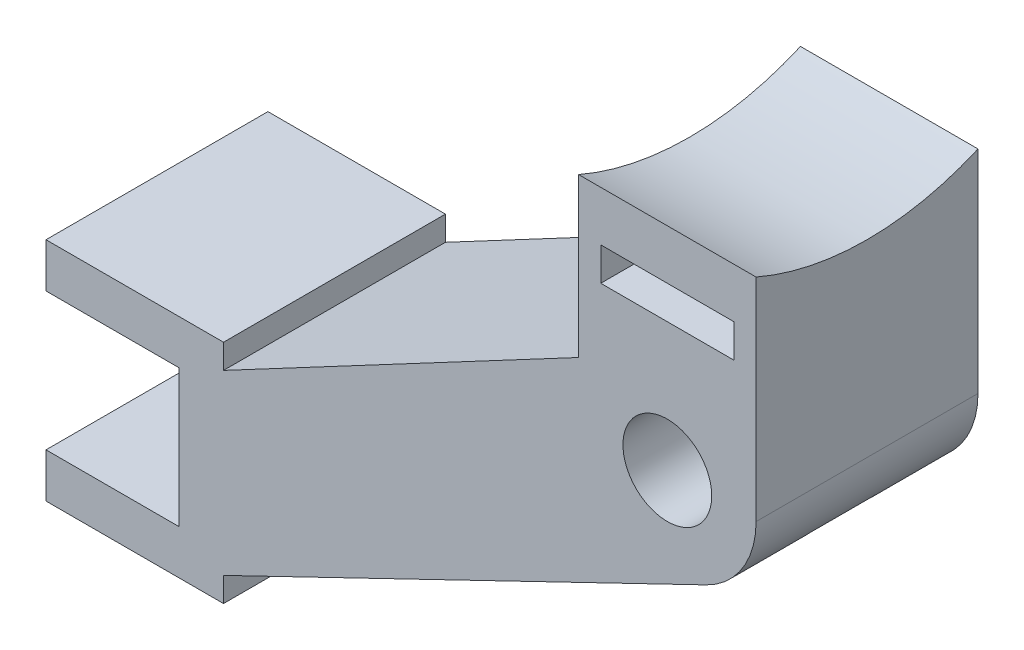
ISO-10303-21;
HEADER;
FILE_DESCRIPTION(('STEP AP214'),'2;1');
FILE_NAME('part.step','',(''),(''),'','','');
FILE_SCHEMA(('AUTOMOTIVE_DESIGN { 1 0 10303 214 1 1 1 1 }'));
ENDSEC;
DATA;
#1=APPLICATION_CONTEXT('core data for automotive mechanical design processes');
#2=APPLICATION_PROTOCOL_DEFINITION('international standard','automotive_design',2000,#1);
#3=PRODUCT_CONTEXT('',#1,'mechanical');
#4=PRODUCT('Part','Part','',(#3));
#5=PRODUCT_RELATED_PRODUCT_CATEGORY('part','',(#4));
#6=PRODUCT_DEFINITION_FORMATION('','',#4);
#7=PRODUCT_DEFINITION_CONTEXT('part definition',#1,'design');
#8=PRODUCT_DEFINITION('design','',#6,#7);
#9=PRODUCT_DEFINITION_SHAPE('','',#8);
#10=(LENGTH_UNIT() NAMED_UNIT(*) SI_UNIT(.MILLI.,.METRE.));
#11=(NAMED_UNIT(*) PLANE_ANGLE_UNIT() SI_UNIT($,.RADIAN.));
#12=(NAMED_UNIT(*) SI_UNIT($,.STERADIAN.) SOLID_ANGLE_UNIT());
#13=UNCERTAINTY_MEASURE_WITH_UNIT(LENGTH_MEASURE(1.E-05),#10,'distance_accuracy_value','');
#14=(GEOMETRIC_REPRESENTATION_CONTEXT(3) GLOBAL_UNCERTAINTY_ASSIGNED_CONTEXT((#13)) GLOBAL_UNIT_ASSIGNED_CONTEXT((#10,
#11,#12)) REPRESENTATION_CONTEXT('',''));
#15=CARTESIAN_POINT('',(0.,0.,0.));
#16=DIRECTION('',(0.,0.,1.));
#17=DIRECTION('',(1.,0.,0.));
#18=AXIS2_PLACEMENT_3D('',#15,#16,#17);
#19=CARTESIAN_POINT('',(-20.,-14.1,10.));
#20=DIRECTION('',(-0.434853391635676,0.900501264731455,0.));
#21=DIRECTION('',(-0.900501264731455,-0.434853391635676,0.));
#22=AXIS2_PLACEMENT_3D('',#19,#20,#21);
#23=PLANE('',#22);
#24=DIRECTION('',(-0.900501264731455,-0.434853391635676,0.));
#25=VECTOR('',#24,1.);
#26=CARTESIAN_POINT('',(-6.64579324577376,-7.65123382151927,3.5));
#27=LINE('',#26,#25);
#28=CARTESIAN_POINT('',(1.7394135665427,-3.60200505892582,3.5));
#29=VERTEX_POINT('',#28);
#30=CARTESIAN_POINT('',(-3.,-5.8906748748309,3.5));
#31=VERTEX_POINT('',#30);
#32=EDGE_CURVE('E200',#29,#31,#27,.T.);
#33=ORIENTED_EDGE('',*,*,#32,.T.);
#34=DIRECTION('',(0.,0.,-1.));
#35=VECTOR('',#34,1.);
#36=CARTESIAN_POINT('',(-3.,-5.8906748748309,3.5));
#37=LINE('',#36,#35);
#38=CARTESIAN_POINT('',(-3.,-5.8906748748309,6.5));
#39=VERTEX_POINT('',#38);
#40=EDGE_CURVE('E211',#39,#31,#37,.T.);
#41=ORIENTED_EDGE('',*,*,#40,.F.);
#42=DIRECTION('',(-0.900501264731455,-0.434853391635676,0.));
#43=VECTOR('',#42,1.);
#44=CARTESIAN_POINT('',(-6.64579324577376,-7.65123382151927,6.5));
#45=LINE('',#44,#43);
#46=CARTESIAN_POINT('',(1.7394135665427,-3.60200505892582,6.5));
#47=VERTEX_POINT('',#46);
#48=EDGE_CURVE('E223',#47,#39,#45,.T.);
#49=ORIENTED_EDGE('',*,*,#48,.F.);
#50=DIRECTION('',(0.,0.,-1.));
#51=VECTOR('',#50,1.);
#52=CARTESIAN_POINT('',(1.7394135665427,-3.60200505892582,10.));
#53=LINE('',#52,#51);
#54=CARTESIAN_POINT('',(1.7394135665427,-3.60200505892582,10.));
#55=VERTEX_POINT('',#54);
#56=EDGE_CURVE('E368',#55,#47,#53,.T.);
#57=ORIENTED_EDGE('',*,*,#56,.F.);
#58=DIRECTION('',(0.900501264731455,0.434853391635676,0.));
#59=VECTOR('',#58,1.);
#60=CARTESIAN_POINT('',(-20.,-14.1,10.));
#61=LINE('',#60,#59);
#62=CARTESIAN_POINT('',(-20.,-14.1,10.));
#63=VERTEX_POINT('',#62);
#64=EDGE_CURVE('E312',#63,#55,#61,.T.);
#65=ORIENTED_EDGE('',*,*,#64,.F.);
#66=DIRECTION('',(0.,0.,-1.));
#67=VECTOR('',#66,1.);
#68=CARTESIAN_POINT('',(-20.,-14.1,10.));
#69=LINE('',#68,#67);
#70=CARTESIAN_POINT('',(-20.,-14.1,0.));
#71=VERTEX_POINT('',#70);
#72=EDGE_CURVE('E371',#63,#71,#69,.T.);
#73=ORIENTED_EDGE('',*,*,#72,.T.);
#74=DIRECTION('',(0.900501264731455,0.434853391635676,0.));
#75=VECTOR('',#74,1.);
#76=CARTESIAN_POINT('',(-20.,-14.1,0.));
#77=LINE('',#76,#75);
#78=CARTESIAN_POINT('',(1.7394135665427,-3.60200505892582,0.));
#79=VERTEX_POINT('',#78);
#80=EDGE_CURVE('E341',#71,#79,#77,.T.);
#81=ORIENTED_EDGE('',*,*,#80,.T.);
#82=EDGE_CURVE('E221',#29,#79,#53,.T.);
#83=ORIENTED_EDGE('',*,*,#82,.F.);
#84=EDGE_LOOP('',(#33,#41,#49,#57,#65,#73,#81,#83));
#85=FACE_BOUND('',#84,.T.);
#86=ADVANCED_FACE('F35',(#85),#23,.F.);
#87=CARTESIAN_POINT('',(0.,0.,10.));
#88=DIRECTION('',(0.,0.,-1.));
#89=DIRECTION('',(-1.,0.,0.));
#90=AXIS2_PLACEMENT_3D('',#87,#88,#89);
#91=CYLINDRICAL_SURFACE('',#90,4.);
#92=CARTESIAN_POINT('',(0.,0.,3.5));
#93=DIRECTION('',(0.,0.,1.));
#94=DIRECTION('',(1.,0.,0.));
#95=AXIS2_PLACEMENT_3D('',#92,#93,#94);
#96=CIRCLE('',#95,4.);
#97=CARTESIAN_POINT('',(3.,-2.64575131106459,3.5));
#98=VERTEX_POINT('',#97);
#99=EDGE_CURVE('E234',#98,#29,#96,.F.);
#100=ORIENTED_EDGE('',*,*,#99,.T.);
#101=ORIENTED_EDGE('',*,*,#82,.T.);
#102=CARTESIAN_POINT('',(0.,0.,0.));
#103=DIRECTION('',(0.,0.,1.));
#104=DIRECTION('',(1.,0.,0.));
#105=AXIS2_PLACEMENT_3D('',#102,#103,#104);
#106=CIRCLE('',#105,4.);
#107=CARTESIAN_POINT('',(4.,0.,0.));
#108=VERTEX_POINT('',#107);
#109=EDGE_CURVE('E343',#79,#108,#106,.T.);
#110=ORIENTED_EDGE('',*,*,#109,.T.);
#111=DIRECTION('',(0.,0.,-1.));
#112=VECTOR('',#111,1.);
#113=CARTESIAN_POINT('',(4.,0.,10.));
#114=LINE('',#113,#112);
#115=CARTESIAN_POINT('',(4.,0.,10.));
#116=VERTEX_POINT('',#115);
#117=EDGE_CURVE('E365',#116,#108,#114,.T.);
#118=ORIENTED_EDGE('',*,*,#117,.F.);
#119=CARTESIAN_POINT('',(0.,0.,10.));
#120=DIRECTION('',(0.,0.,1.));
#121=DIRECTION('',(1.,0.,0.));
#122=AXIS2_PLACEMENT_3D('',#119,#120,#121);
#123=CIRCLE('',#122,4.);
#124=EDGE_CURVE('E314',#55,#116,#123,.T.);
#125=ORIENTED_EDGE('',*,*,#124,.F.);
#126=ORIENTED_EDGE('',*,*,#56,.T.);
#127=CARTESIAN_POINT('',(0.,0.,6.5));
#128=DIRECTION('',(0.,0.,1.));
#129=DIRECTION('',(1.,0.,0.));
#130=AXIS2_PLACEMENT_3D('',#127,#128,#129);
#131=CIRCLE('',#130,4.);
#132=CARTESIAN_POINT('',(3.,-2.64575131106459,6.5));
#133=VERTEX_POINT('',#132);
#134=EDGE_CURVE('E216',#133,#47,#131,.F.);
#135=ORIENTED_EDGE('',*,*,#134,.F.);
#136=DIRECTION('',(0.,0.,-1.));
#137=VECTOR('',#136,1.);
#138=CARTESIAN_POINT('',(3.,-2.64575131106459,10.));
#139=LINE('',#138,#137);
#140=EDGE_CURVE('E50',#133,#98,#139,.T.);
#141=ORIENTED_EDGE('',*,*,#140,.T.);
#142=EDGE_LOOP('',(#100,#101,#110,#118,#125,#126,#135,#141));
#143=FACE_BOUND('',#142,.T.);
#144=ADVANCED_FACE('F451',(#143),#91,.T.);
#145=CARTESIAN_POINT('',(0.,0.,10.));
#146=DIRECTION('',(0.,0.,-1.));
#147=DIRECTION('',(-1.,0.,0.));
#148=AXIS2_PLACEMENT_3D('',#145,#146,#147);
#149=CYLINDRICAL_SURFACE('',#148,2.);
#150=CARTESIAN_POINT('',(0.,0.,0.));
#151=DIRECTION('',(0.,0.,1.));
#152=DIRECTION('',(1.,0.,0.));
#153=AXIS2_PLACEMENT_3D('',#150,#151,#152);
#154=CIRCLE('',#153,2.);
#155=CARTESIAN_POINT('',(2.,0.,0.));
#156=VERTEX_POINT('',#155);
#157=EDGE_CURVE('E289',#156,#156,#154,.T.);
#158=ORIENTED_EDGE('',*,*,#157,.F.);
#159=EDGE_LOOP('',(#158));
#160=FACE_BOUND('',#159,.T.);
#161=CARTESIAN_POINT('',(0.,0.,3.5));
#162=DIRECTION('',(0.,0.,1.));
#163=DIRECTION('',(1.,0.,0.));
#164=AXIS2_PLACEMENT_3D('',#161,#162,#163);
#165=CIRCLE('',#164,2.);
#166=CARTESIAN_POINT('',(2.,0.,3.5));
#167=VERTEX_POINT('',#166);
#168=EDGE_CURVE('E229',#167,#167,#165,.F.);
#169=ORIENTED_EDGE('',*,*,#168,.F.);
#170=EDGE_LOOP('',(#169));
#171=FACE_BOUND('',#170,.T.);
#172=ADVANCED_FACE('F473',(#160,#171),#149,.F.);
#173=CARTESIAN_POINT('',(0.,0.,10.));
#174=DIRECTION('',(0.,0.,1.));
#175=DIRECTION('',(1.,0.,0.));
#176=AXIS2_PLACEMENT_3D('',#173,#174,#175);
#177=PLANE('',#176);
#178=DIRECTION('',(0.,-1.,0.));
#179=VECTOR('',#178,1.);
#180=CARTESIAN_POINT('',(-28.,-7.,10.));
#181=LINE('',#180,#179);
#182=CARTESIAN_POINT('',(-28.,-5.,10.));
#183=VERTEX_POINT('',#182);
#184=CARTESIAN_POINT('',(-28.,-7.,10.));
#185=VERTEX_POINT('',#184);
#186=EDGE_CURVE('E296',#183,#185,#181,.T.);
#187=ORIENTED_EDGE('',*,*,#186,.T.);
#188=DIRECTION('',(1.,0.,0.));
#189=VECTOR('',#188,1.);
#190=CARTESIAN_POINT('',(-28.,-7.,10.));
#191=LINE('',#190,#189);
#192=CARTESIAN_POINT('',(-22.,-7.,10.));
#193=VERTEX_POINT('',#192);
#194=EDGE_CURVE('E299',#185,#193,#191,.T.);
#195=ORIENTED_EDGE('',*,*,#194,.T.);
#196=DIRECTION('',(0.,-1.,0.));
#197=VECTOR('',#196,1.);
#198=CARTESIAN_POINT('',(-22.,-7.,10.));
#199=LINE('',#198,#197);
#200=CARTESIAN_POINT('',(-22.,-13.2,10.));
#201=VERTEX_POINT('',#200);
#202=EDGE_CURVE('E302',#193,#201,#199,.T.);
#203=ORIENTED_EDGE('',*,*,#202,.T.);
#204=DIRECTION('',(-1.,0.,0.));
#205=VECTOR('',#204,1.);
#206=CARTESIAN_POINT('',(-22.,-13.2,10.));
#207=LINE('',#206,#205);
#208=CARTESIAN_POINT('',(-28.,-13.2,10.));
#209=VERTEX_POINT('',#208);
#210=EDGE_CURVE('E304',#201,#209,#207,.T.);
#211=ORIENTED_EDGE('',*,*,#210,.T.);
#212=DIRECTION('',(0.,-1.,0.));
#213=VECTOR('',#212,1.);
#214=CARTESIAN_POINT('',(-28.,-13.2,10.));
#215=LINE('',#214,#213);
#216=CARTESIAN_POINT('',(-28.,-15.2,10.));
#217=VERTEX_POINT('',#216);
#218=EDGE_CURVE('E306',#209,#217,#215,.T.);
#219=ORIENTED_EDGE('',*,*,#218,.T.);
#220=DIRECTION('',(1.,0.,0.));
#221=VECTOR('',#220,1.);
#222=CARTESIAN_POINT('',(-28.,-15.2,10.));
#223=LINE('',#222,#221);
#224=CARTESIAN_POINT('',(-20.,-15.2,10.));
#225=VERTEX_POINT('',#224);
#226=EDGE_CURVE('E308',#217,#225,#223,.T.);
#227=ORIENTED_EDGE('',*,*,#226,.T.);
#228=DIRECTION('',(0.,1.,0.));
#229=VECTOR('',#228,1.);
#230=CARTESIAN_POINT('',(-20.,-15.2,10.));
#231=LINE('',#230,#229);
#232=EDGE_CURVE('E310',#225,#63,#231,.T.);
#233=ORIENTED_EDGE('',*,*,#232,.T.);
#234=ORIENTED_EDGE('',*,*,#64,.T.);
#235=ORIENTED_EDGE('',*,*,#124,.T.);
#236=DIRECTION('',(0.,1.,0.));
#237=VECTOR('',#236,1.);
#238=CARTESIAN_POINT('',(4.,8.,10.));
#239=LINE('',#238,#237);
#240=CARTESIAN_POINT('',(4.,9.5435607626104,10.));
#241=VERTEX_POINT('',#240);
#242=EDGE_CURVE('E316',#116,#241,#239,.T.);
#243=ORIENTED_EDGE('',*,*,#242,.T.);
#244=DIRECTION('',(-1.,0.,0.));
#245=VECTOR('',#244,1.);
#246=CARTESIAN_POINT('',(14.118427734973,9.5435607626104,10.));
#247=LINE('',#246,#245);
#248=CARTESIAN_POINT('',(-4.,9.5435607626104,10.));
#249=VERTEX_POINT('',#248);
#250=EDGE_CURVE('E253',#241,#249,#247,.T.);
#251=ORIENTED_EDGE('',*,*,#250,.T.);
#252=DIRECTION('',(0.,-1.,0.));
#253=VECTOR('',#252,1.);
#254=CARTESIAN_POINT('',(-4.,2.40390021292767,10.));
#255=LINE('',#254,#253);
#256=CARTESIAN_POINT('',(-4.,2.40390021292767,10.));
#257=VERTEX_POINT('',#256);
#258=EDGE_CURVE('E318',#249,#257,#255,.T.);
#259=ORIENTED_EDGE('',*,*,#258,.T.);
#260=DIRECTION('',(-0.883026521697402,-0.469323089117708,0.));
#261=VECTOR('',#260,1.);
#262=CARTESIAN_POINT('',(-20.,-6.1,10.));
#263=LINE('',#262,#261);
#264=CARTESIAN_POINT('',(-20.,-6.1,10.));
#265=VERTEX_POINT('',#264);
#266=EDGE_CURVE('E320',#257,#265,#263,.T.);
#267=ORIENTED_EDGE('',*,*,#266,.T.);
#268=DIRECTION('',(0.,1.,0.));
#269=VECTOR('',#268,1.);
#270=CARTESIAN_POINT('',(-20.,-5.,10.));
#271=LINE('',#270,#269);
#272=CARTESIAN_POINT('',(-20.,-5.,10.));
#273=VERTEX_POINT('',#272);
#274=EDGE_CURVE('E322',#265,#273,#271,.T.);
#275=ORIENTED_EDGE('',*,*,#274,.T.);
#276=DIRECTION('',(-1.,0.,0.));
#277=VECTOR('',#276,1.);
#278=CARTESIAN_POINT('',(-28.,-5.,10.));
#279=LINE('',#278,#277);
#280=EDGE_CURVE('E324',#273,#183,#279,.T.);
#281=ORIENTED_EDGE('',*,*,#280,.T.);
#282=EDGE_LOOP('',(#187,#195,#203,#211,#219,#227,#233,#234,#235,#243,#251,#259,#267,#275,#281));
#283=FACE_BOUND('',#282,.T.);
#284=CARTESIAN_POINT('',(0.,0.,10.));
#285=DIRECTION('',(0.,0.,1.));
#286=DIRECTION('',(1.,0.,0.));
#287=AXIS2_PLACEMENT_3D('',#284,#285,#286);
#288=CIRCLE('',#287,2.);
#289=CARTESIAN_POINT('',(2.,0.,10.));
#290=VERTEX_POINT('',#289);
#291=EDGE_CURVE('E290',#290,#290,#288,.T.);
#292=ORIENTED_EDGE('',*,*,#291,.F.);
#293=EDGE_LOOP('',(#292));
#294=FACE_BOUND('',#293,.T.);
#295=DIRECTION('',(-1.,0.,0.));
#296=VECTOR('',#295,1.);
#297=CARTESIAN_POINT('',(-3.,7.3,10.));
#298=LINE('',#297,#296);
#299=CARTESIAN_POINT('',(3.,7.3,10.));
#300=VERTEX_POINT('',#299);
#301=CARTESIAN_POINT('',(-3.,7.3,10.));
#302=VERTEX_POINT('',#301);
#303=EDGE_CURVE('E263',#300,#302,#298,.T.);
#304=ORIENTED_EDGE('',*,*,#303,.F.);
#305=DIRECTION('',(0.,1.,0.));
#306=VECTOR('',#305,1.);
#307=CARTESIAN_POINT('',(3.,7.3,10.));
#308=LINE('',#307,#306);
#309=CARTESIAN_POINT('',(3.,5.8,10.));
#310=VERTEX_POINT('',#309);
#311=EDGE_CURVE('E261',#310,#300,#308,.T.);
#312=ORIENTED_EDGE('',*,*,#311,.F.);
#313=DIRECTION('',(1.,0.,0.));
#314=VECTOR('',#313,1.);
#315=CARTESIAN_POINT('',(-3.,5.8,10.));
#316=LINE('',#315,#314);
#317=CARTESIAN_POINT('',(-3.,5.8,10.));
#318=VERTEX_POINT('',#317);
#319=EDGE_CURVE('E268',#318,#310,#316,.T.);
#320=ORIENTED_EDGE('',*,*,#319,.F.);
#321=DIRECTION('',(0.,-1.,0.));
#322=VECTOR('',#321,1.);
#323=CARTESIAN_POINT('',(-3.,7.3,10.));
#324=LINE('',#323,#322);
#325=EDGE_CURVE('E266',#302,#318,#324,.T.);
#326=ORIENTED_EDGE('',*,*,#325,.F.);
#327=EDGE_LOOP('',(#304,#312,#320,#326));
#328=FACE_BOUND('',#327,.T.);
#329=ADVANCED_FACE('F410',(#283,#294,#328),#177,.T.);
#330=CARTESIAN_POINT('',(0.,0.,0.));
#331=DIRECTION('',(0.,0.,1.));
#332=DIRECTION('',(1.,0.,0.));
#333=AXIS2_PLACEMENT_3D('',#330,#331,#332);
#334=PLANE('',#333);
#335=ORIENTED_EDGE('',*,*,#157,.T.);
#336=EDGE_LOOP('',(#335));
#337=FACE_BOUND('',#336,.T.);
#338=DIRECTION('',(0.,-1.,0.));
#339=VECTOR('',#338,1.);
#340=CARTESIAN_POINT('',(-28.,-7.,0.));
#341=LINE('',#340,#339);
#342=CARTESIAN_POINT('',(-28.,-5.,0.));
#343=VERTEX_POINT('',#342);
#344=CARTESIAN_POINT('',(-28.,-7.,0.));
#345=VERTEX_POINT('',#344);
#346=EDGE_CURVE('E293',#343,#345,#341,.T.);
#347=ORIENTED_EDGE('',*,*,#346,.F.);
#348=DIRECTION('',(-1.,0.,0.));
#349=VECTOR('',#348,1.);
#350=CARTESIAN_POINT('',(-28.,-5.,0.));
#351=LINE('',#350,#349);
#352=CARTESIAN_POINT('',(-20.,-5.,0.));
#353=VERTEX_POINT('',#352);
#354=EDGE_CURVE('E300',#353,#343,#351,.T.);
#355=ORIENTED_EDGE('',*,*,#354,.F.);
#356=DIRECTION('',(0.,1.,0.));
#357=VECTOR('',#356,1.);
#358=CARTESIAN_POINT('',(-20.,-5.,0.));
#359=LINE('',#358,#357);
#360=CARTESIAN_POINT('',(-20.,-6.1,0.));
#361=VERTEX_POINT('',#360);
#362=EDGE_CURVE('E351',#361,#353,#359,.T.);
#363=ORIENTED_EDGE('',*,*,#362,.F.);
#364=DIRECTION('',(-0.883026521697402,-0.469323089117708,0.));
#365=VECTOR('',#364,1.);
#366=CARTESIAN_POINT('',(-20.,-6.1,0.));
#367=LINE('',#366,#365);
#368=CARTESIAN_POINT('',(-4.,2.40390021292767,0.));
#369=VERTEX_POINT('',#368);
#370=EDGE_CURVE('E349',#369,#361,#367,.T.);
#371=ORIENTED_EDGE('',*,*,#370,.F.);
#372=DIRECTION('',(0.,-1.,0.));
#373=VECTOR('',#372,1.);
#374=CARTESIAN_POINT('',(-4.,2.40390021292767,0.));
#375=LINE('',#374,#373);
#376=CARTESIAN_POINT('',(-4.,9.54356076261041,0.));
#377=VERTEX_POINT('',#376);
#378=EDGE_CURVE('E347',#377,#369,#375,.T.);
#379=ORIENTED_EDGE('',*,*,#378,.F.);
#380=DIRECTION('',(-1.,0.,0.));
#381=VECTOR('',#380,1.);
#382=CARTESIAN_POINT('',(14.118427734973,9.54356076261041,0.));
#383=LINE('',#382,#381);
#384=CARTESIAN_POINT('',(4.,9.54356076261041,0.));
#385=VERTEX_POINT('',#384);
#386=EDGE_CURVE('E256',#385,#377,#383,.T.);
#387=ORIENTED_EDGE('',*,*,#386,.F.);
#388=DIRECTION('',(0.,1.,0.));
#389=VECTOR('',#388,1.);
#390=CARTESIAN_POINT('',(4.,8.,0.));
#391=LINE('',#390,#389);
#392=EDGE_CURVE('E345',#108,#385,#391,.T.);
#393=ORIENTED_EDGE('',*,*,#392,.F.);
#394=ORIENTED_EDGE('',*,*,#109,.F.);
#395=ORIENTED_EDGE('',*,*,#80,.F.);
#396=DIRECTION('',(0.,1.,0.));
#397=VECTOR('',#396,1.);
#398=CARTESIAN_POINT('',(-20.,-15.2,0.));
#399=LINE('',#398,#397);
#400=CARTESIAN_POINT('',(-20.,-15.2,0.));
#401=VERTEX_POINT('',#400);
#402=EDGE_CURVE('E339',#401,#71,#399,.T.);
#403=ORIENTED_EDGE('',*,*,#402,.F.);
#404=DIRECTION('',(1.,0.,0.));
#405=VECTOR('',#404,1.);
#406=CARTESIAN_POINT('',(-28.,-15.2,0.));
#407=LINE('',#406,#405);
#408=CARTESIAN_POINT('',(-28.,-15.2,0.));
#409=VERTEX_POINT('',#408);
#410=EDGE_CURVE('E337',#409,#401,#407,.T.);
#411=ORIENTED_EDGE('',*,*,#410,.F.);
#412=DIRECTION('',(0.,-1.,0.));
#413=VECTOR('',#412,1.);
#414=CARTESIAN_POINT('',(-28.,-13.2,0.));
#415=LINE('',#414,#413);
#416=CARTESIAN_POINT('',(-28.,-13.2,0.));
#417=VERTEX_POINT('',#416);
#418=EDGE_CURVE('E335',#417,#409,#415,.T.);
#419=ORIENTED_EDGE('',*,*,#418,.F.);
#420=DIRECTION('',(-1.,0.,0.));
#421=VECTOR('',#420,1.);
#422=CARTESIAN_POINT('',(-22.,-13.2,0.));
#423=LINE('',#422,#421);
#424=CARTESIAN_POINT('',(-22.,-13.2,0.));
#425=VERTEX_POINT('',#424);
#426=EDGE_CURVE('E333',#425,#417,#423,.T.);
#427=ORIENTED_EDGE('',*,*,#426,.F.);
#428=DIRECTION('',(0.,-1.,0.));
#429=VECTOR('',#428,1.);
#430=CARTESIAN_POINT('',(-22.,-7.,0.));
#431=LINE('',#430,#429);
#432=CARTESIAN_POINT('',(-22.,-7.,0.));
#433=VERTEX_POINT('',#432);
#434=EDGE_CURVE('E331',#433,#425,#431,.T.);
#435=ORIENTED_EDGE('',*,*,#434,.F.);
#436=DIRECTION('',(1.,0.,0.));
#437=VECTOR('',#436,1.);
#438=CARTESIAN_POINT('',(-28.,-7.,0.));
#439=LINE('',#438,#437);
#440=EDGE_CURVE('E329',#345,#433,#439,.T.);
#441=ORIENTED_EDGE('',*,*,#440,.F.);
#442=EDGE_LOOP('',(#347,#355,#363,#371,#379,#387,#393,#394,#395,#403,#411,#419,#427,#435,#441));
#443=FACE_BOUND('',#442,.T.);
#444=DIRECTION('',(0.,1.,0.));
#445=VECTOR('',#444,1.);
#446=CARTESIAN_POINT('',(3.,7.3,0.));
#447=LINE('',#446,#445);
#448=CARTESIAN_POINT('',(3.,5.8,0.));
#449=VERTEX_POINT('',#448);
#450=CARTESIAN_POINT('',(3.,7.3,0.));
#451=VERTEX_POINT('',#450);
#452=EDGE_CURVE('E252',#449,#451,#447,.T.);
#453=ORIENTED_EDGE('',*,*,#452,.T.);
#454=DIRECTION('',(-1.,0.,0.));
#455=VECTOR('',#454,1.);
#456=CARTESIAN_POINT('',(-3.,7.3,0.));
#457=LINE('',#456,#455);
#458=CARTESIAN_POINT('',(-3.,7.3,0.));
#459=VERTEX_POINT('',#458);
#460=EDGE_CURVE('E273',#451,#459,#457,.T.);
#461=ORIENTED_EDGE('',*,*,#460,.T.);
#462=DIRECTION('',(0.,-1.,0.));
#463=VECTOR('',#462,1.);
#464=CARTESIAN_POINT('',(-3.,7.3,0.));
#465=LINE('',#464,#463);
#466=CARTESIAN_POINT('',(-3.,5.8,0.));
#467=VERTEX_POINT('',#466);
#468=EDGE_CURVE('E276',#459,#467,#465,.T.);
#469=ORIENTED_EDGE('',*,*,#468,.T.);
#470=DIRECTION('',(1.,0.,0.));
#471=VECTOR('',#470,1.);
#472=CARTESIAN_POINT('',(-3.,5.8,0.));
#473=LINE('',#472,#471);
#474=EDGE_CURVE('E264',#467,#449,#473,.T.);
#475=ORIENTED_EDGE('',*,*,#474,.T.);
#476=EDGE_LOOP('',(#453,#461,#469,#475));
#477=FACE_BOUND('',#476,.T.);
#478=ADVANCED_FACE('F396',(#337,#443,#477),#334,.F.);
#479=CARTESIAN_POINT('',(-28.,-7.,10.));
#480=DIRECTION('',(1.,0.,0.));
#481=DIRECTION('',(0.,0.,-1.));
#482=AXIS2_PLACEMENT_3D('',#479,#480,#481);
#483=PLANE('',#482);
#484=ORIENTED_EDGE('',*,*,#346,.T.);
#485=DIRECTION('',(0.,0.,-1.));
#486=VECTOR('',#485,1.);
#487=CARTESIAN_POINT('',(-28.,-7.,10.));
#488=LINE('',#487,#486);
#489=EDGE_CURVE('E11',#185,#345,#488,.T.);
#490=ORIENTED_EDGE('',*,*,#489,.F.);
#491=ORIENTED_EDGE('',*,*,#186,.F.);
#492=DIRECTION('',(0.,0.,-1.));
#493=VECTOR('',#492,1.);
#494=CARTESIAN_POINT('',(-28.,-5.,10.));
#495=LINE('',#494,#493);
#496=EDGE_CURVE('E326',#183,#343,#495,.T.);
#497=ORIENTED_EDGE('',*,*,#496,.T.);
#498=EDGE_LOOP('',(#484,#490,#491,#497));
#499=FACE_BOUND('',#498,.T.);
#500=ADVANCED_FACE('F37',(#499),#483,.F.);
#501=CARTESIAN_POINT('',(-28.,-7.,10.));
#502=DIRECTION('',(0.,1.,0.));
#503=DIRECTION('',(0.,0.,1.));
#504=AXIS2_PLACEMENT_3D('',#501,#502,#503);
#505=PLANE('',#504);
#506=ORIENTED_EDGE('',*,*,#440,.T.);
#507=DIRECTION('',(0.,0.,-1.));
#508=VECTOR('',#507,1.);
#509=CARTESIAN_POINT('',(-22.,-7.,10.));
#510=LINE('',#509,#508);
#511=EDGE_CURVE('E43',#193,#433,#510,.T.);
#512=ORIENTED_EDGE('',*,*,#511,.F.);
#513=ORIENTED_EDGE('',*,*,#194,.F.);
#514=ORIENTED_EDGE('',*,*,#489,.T.);
#515=EDGE_LOOP('',(#506,#512,#513,#514));
#516=FACE_BOUND('',#515,.T.);
#517=ADVANCED_FACE('F415',(#516),#505,.F.);
#518=CARTESIAN_POINT('',(-22.,-7.,10.));
#519=DIRECTION('',(1.,0.,0.));
#520=DIRECTION('',(0.,1.,0.));
#521=AXIS2_PLACEMENT_3D('',#518,#519,#520);
#522=PLANE('',#521);
#523=ORIENTED_EDGE('',*,*,#434,.T.);
#524=DIRECTION('',(0.,0.,-1.));
#525=VECTOR('',#524,1.);
#526=CARTESIAN_POINT('',(-22.,-13.2,10.));
#527=LINE('',#526,#525);
#528=EDGE_CURVE('E383',#201,#425,#527,.T.);
#529=ORIENTED_EDGE('',*,*,#528,.F.);
#530=ORIENTED_EDGE('',*,*,#202,.F.);
#531=ORIENTED_EDGE('',*,*,#511,.T.);
#532=EDGE_LOOP('',(#523,#529,#530,#531));
#533=FACE_BOUND('',#532,.T.);
#534=ADVANCED_FACE('F390',(#533),#522,.F.);
#535=CARTESIAN_POINT('',(-22.,-13.2,10.));
#536=DIRECTION('',(0.,-1.,0.));
#537=DIRECTION('',(1.,0.,0.));
#538=AXIS2_PLACEMENT_3D('',#535,#536,#537);
#539=PLANE('',#538);
#540=ORIENTED_EDGE('',*,*,#426,.T.);
#541=DIRECTION('',(0.,0.,-1.));
#542=VECTOR('',#541,1.);
#543=CARTESIAN_POINT('',(-28.,-13.2,10.));
#544=LINE('',#543,#542);
#545=EDGE_CURVE('E380',#209,#417,#544,.T.);
#546=ORIENTED_EDGE('',*,*,#545,.F.);
#547=ORIENTED_EDGE('',*,*,#210,.F.);
#548=ORIENTED_EDGE('',*,*,#528,.T.);
#549=EDGE_LOOP('',(#540,#546,#547,#548));
#550=FACE_BOUND('',#549,.T.);
#551=ADVANCED_FACE('F402',(#550),#539,.F.);
#552=CARTESIAN_POINT('',(-28.,-13.2,10.));
#553=DIRECTION('',(1.,0.,0.));
#554=DIRECTION('',(0.,0.,-1.));
#555=AXIS2_PLACEMENT_3D('',#552,#553,#554);
#556=PLANE('',#555);
#557=ORIENTED_EDGE('',*,*,#418,.T.);
#558=DIRECTION('',(0.,0.,-1.));
#559=VECTOR('',#558,1.);
#560=CARTESIAN_POINT('',(-28.,-15.2,10.));
#561=LINE('',#560,#559);
#562=EDGE_CURVE('E377',#217,#409,#561,.T.);
#563=ORIENTED_EDGE('',*,*,#562,.F.);
#564=ORIENTED_EDGE('',*,*,#218,.F.);
#565=ORIENTED_EDGE('',*,*,#545,.T.);
#566=EDGE_LOOP('',(#557,#563,#564,#565));
#567=FACE_BOUND('',#566,.T.);
#568=ADVANCED_FACE('F406',(#567),#556,.F.);
#569=CARTESIAN_POINT('',(-28.,-15.2,10.));
#570=DIRECTION('',(0.,1.,0.));
#571=DIRECTION('',(-1.,0.,0.));
#572=AXIS2_PLACEMENT_3D('',#569,#570,#571);
#573=PLANE('',#572);
#574=ORIENTED_EDGE('',*,*,#410,.T.);
#575=DIRECTION('',(0.,0.,-1.));
#576=VECTOR('',#575,1.);
#577=CARTESIAN_POINT('',(-20.,-15.2,10.));
#578=LINE('',#577,#576);
#579=EDGE_CURVE('E374',#225,#401,#578,.T.);
#580=ORIENTED_EDGE('',*,*,#579,.F.);
#581=ORIENTED_EDGE('',*,*,#226,.F.);
#582=ORIENTED_EDGE('',*,*,#562,.T.);
#583=EDGE_LOOP('',(#574,#580,#581,#582));
#584=FACE_BOUND('',#583,.T.);
#585=ADVANCED_FACE('F459',(#584),#573,.F.);
#586=CARTESIAN_POINT('',(-20.,-15.2,10.));
#587=DIRECTION('',(-1.,0.,0.));
#588=DIRECTION('',(0.,-1.,0.));
#589=AXIS2_PLACEMENT_3D('',#586,#587,#588);
#590=PLANE('',#589);
#591=ORIENTED_EDGE('',*,*,#402,.T.);
#592=ORIENTED_EDGE('',*,*,#72,.F.);
#593=ORIENTED_EDGE('',*,*,#232,.F.);
#594=ORIENTED_EDGE('',*,*,#579,.T.);
#595=EDGE_LOOP('',(#591,#592,#593,#594));
#596=FACE_BOUND('',#595,.T.);
#597=ADVANCED_FACE('F457',(#596),#590,.F.);
#598=CARTESIAN_POINT('',(4.,8.,10.));
#599=DIRECTION('',(-1.,0.,0.));
#600=DIRECTION('',(0.,-1.,0.));
#601=AXIS2_PLACEMENT_3D('',#598,#599,#600);
#602=PLANE('',#601);
#603=ORIENTED_EDGE('',*,*,#392,.T.);
#604=CARTESIAN_POINT('',(4.,21.,5.));
#605=DIRECTION('',(-1.,0.,0.));
#606=DIRECTION('',(0.,-1.,0.));
#607=AXIS2_PLACEMENT_3D('',#604,#605,#606);
#608=CIRCLE('',#607,12.5);
#609=EDGE_CURVE('E249',#385,#241,#608,.T.);
#610=ORIENTED_EDGE('',*,*,#609,.T.);
#611=ORIENTED_EDGE('',*,*,#242,.F.);
#612=ORIENTED_EDGE('',*,*,#117,.T.);
#613=EDGE_LOOP('',(#603,#610,#611,#612));
#614=FACE_BOUND('',#613,.T.);
#615=ADVANCED_FACE('F446',(#614),#602,.F.);
#616=CARTESIAN_POINT('',(-4.,2.40390021292767,10.));
#617=DIRECTION('',(1.,0.,0.));
#618=DIRECTION('',(0.,1.,0.));
#619=AXIS2_PLACEMENT_3D('',#616,#617,#618);
#620=PLANE('',#619);
#621=ORIENTED_EDGE('',*,*,#378,.T.);
#622=DIRECTION('',(0.,0.,-1.));
#623=VECTOR('',#622,1.);
#624=CARTESIAN_POINT('',(-4.,2.40390021292767,10.));
#625=LINE('',#624,#623);
#626=EDGE_CURVE('E362',#257,#369,#625,.T.);
#627=ORIENTED_EDGE('',*,*,#626,.F.);
#628=ORIENTED_EDGE('',*,*,#258,.F.);
#629=CARTESIAN_POINT('',(-4.,21.,5.));
#630=DIRECTION('',(1.,0.,0.));
#631=DIRECTION('',(0.,0.,-1.));
#632=AXIS2_PLACEMENT_3D('',#629,#630,#631);
#633=CIRCLE('',#632,12.5);
#634=EDGE_CURVE('E232',#249,#377,#633,.T.);
#635=ORIENTED_EDGE('',*,*,#634,.T.);
#636=EDGE_LOOP('',(#621,#627,#628,#635));
#637=FACE_BOUND('',#636,.T.);
#638=ADVANCED_FACE('F441',(#637),#620,.F.);
#639=CARTESIAN_POINT('',(-20.,-6.1,10.));
#640=DIRECTION('',(0.469323089117708,-0.883026521697402,0.));
#641=DIRECTION('',(0.883026521697402,0.469323089117708,0.));
#642=AXIS2_PLACEMENT_3D('',#639,#640,#641);
#643=PLANE('',#642);
#644=ORIENTED_EDGE('',*,*,#370,.T.);
#645=DIRECTION('',(0.,0.,-1.));
#646=VECTOR('',#645,1.);
#647=CARTESIAN_POINT('',(-20.,-6.1,10.));
#648=LINE('',#647,#646);
#649=EDGE_CURVE('E359',#265,#361,#648,.T.);
#650=ORIENTED_EDGE('',*,*,#649,.F.);
#651=ORIENTED_EDGE('',*,*,#266,.F.);
#652=ORIENTED_EDGE('',*,*,#626,.T.);
#653=EDGE_LOOP('',(#644,#650,#651,#652));
#654=FACE_BOUND('',#653,.T.);
#655=ADVANCED_FACE('F431',(#654),#643,.F.);
#656=CARTESIAN_POINT('',(-20.,-5.,10.));
#657=DIRECTION('',(-1.,0.,0.));
#658=DIRECTION('',(0.,0.,1.));
#659=AXIS2_PLACEMENT_3D('',#656,#657,#658);
#660=PLANE('',#659);
#661=ORIENTED_EDGE('',*,*,#362,.T.);
#662=DIRECTION('',(0.,0.,-1.));
#663=VECTOR('',#662,1.);
#664=CARTESIAN_POINT('',(-20.,-5.,10.));
#665=LINE('',#664,#663);
#666=EDGE_CURVE('E356',#273,#353,#665,.T.);
#667=ORIENTED_EDGE('',*,*,#666,.F.);
#668=ORIENTED_EDGE('',*,*,#274,.F.);
#669=ORIENTED_EDGE('',*,*,#649,.T.);
#670=EDGE_LOOP('',(#661,#667,#668,#669));
#671=FACE_BOUND('',#670,.T.);
#672=ADVANCED_FACE('F427',(#671),#660,.F.);
#673=CARTESIAN_POINT('',(-28.,-5.,10.));
#674=DIRECTION('',(0.,-1.,0.));
#675=DIRECTION('',(1.,0.,0.));
#676=AXIS2_PLACEMENT_3D('',#673,#674,#675);
#677=PLANE('',#676);
#678=ORIENTED_EDGE('',*,*,#354,.T.);
#679=ORIENTED_EDGE('',*,*,#496,.F.);
#680=ORIENTED_EDGE('',*,*,#280,.F.);
#681=ORIENTED_EDGE('',*,*,#666,.T.);
#682=EDGE_LOOP('',(#678,#679,#680,#681));
#683=FACE_BOUND('',#682,.T.);
#684=ADVANCED_FACE('F422',(#683),#677,.F.);
#685=CARTESIAN_POINT('',(0.,0.,6.5));
#686=DIRECTION('',(0.,0.,1.));
#687=DIRECTION('',(1.,0.,0.));
#688=AXIS2_PLACEMENT_3D('',#685,#686,#687);
#689=CIRCLE('',#688,2.);
#690=CARTESIAN_POINT('',(2.,0.,6.5));
#691=VERTEX_POINT('',#690);
#692=EDGE_CURVE('E222',#691,#691,#689,.F.);
#693=ORIENTED_EDGE('',*,*,#692,.T.);
#694=EDGE_LOOP('',(#693));
#695=FACE_BOUND('',#694,.T.);
#696=ORIENTED_EDGE('',*,*,#291,.T.);
#697=EDGE_LOOP('',(#696));
#698=FACE_BOUND('',#697,.T.);
#699=ADVANCED_FACE('F486',(#695,#698),#149,.F.);
#700=CARTESIAN_POINT('',(3.,7.3,10.));
#701=DIRECTION('',(-1.,0.,0.));
#702=DIRECTION('',(0.,0.,1.));
#703=AXIS2_PLACEMENT_3D('',#700,#701,#702);
#704=PLANE('',#703);
#705=ORIENTED_EDGE('',*,*,#452,.F.);
#706=DIRECTION('',(0.,0.,-1.));
#707=VECTOR('',#706,1.);
#708=CARTESIAN_POINT('',(3.,5.8,10.));
#709=LINE('',#708,#707);
#710=EDGE_CURVE('E270',#310,#449,#709,.T.);
#711=ORIENTED_EDGE('',*,*,#710,.F.);
#712=ORIENTED_EDGE('',*,*,#311,.T.);
#713=DIRECTION('',(0.,0.,-1.));
#714=VECTOR('',#713,1.);
#715=CARTESIAN_POINT('',(3.,7.3,10.));
#716=LINE('',#715,#714);
#717=EDGE_CURVE('E286',#300,#451,#716,.T.);
#718=ORIENTED_EDGE('',*,*,#717,.T.);
#719=EDGE_LOOP('',(#705,#711,#712,#718));
#720=FACE_BOUND('',#719,.T.);
#721=ADVANCED_FACE('F494',(#720),#704,.T.);
#722=CARTESIAN_POINT('',(-3.,7.3,10.));
#723=DIRECTION('',(0.,-1.,0.));
#724=DIRECTION('',(1.,0.,0.));
#725=AXIS2_PLACEMENT_3D('',#722,#723,#724);
#726=PLANE('',#725);
#727=ORIENTED_EDGE('',*,*,#460,.F.);
#728=ORIENTED_EDGE('',*,*,#717,.F.);
#729=ORIENTED_EDGE('',*,*,#303,.T.);
#730=DIRECTION('',(0.,0.,-1.));
#731=VECTOR('',#730,1.);
#732=CARTESIAN_POINT('',(-3.,7.3,10.));
#733=LINE('',#732,#731);
#734=EDGE_CURVE('E284',#302,#459,#733,.T.);
#735=ORIENTED_EDGE('',*,*,#734,.T.);
#736=EDGE_LOOP('',(#727,#728,#729,#735));
#737=FACE_BOUND('',#736,.T.);
#738=ADVANCED_FACE('F498',(#737),#726,.T.);
#739=CARTESIAN_POINT('',(-3.,7.3,10.));
#740=DIRECTION('',(1.,0.,0.));
#741=DIRECTION('',(0.,0.,-1.));
#742=AXIS2_PLACEMENT_3D('',#739,#740,#741);
#743=PLANE('',#742);
#744=ORIENTED_EDGE('',*,*,#468,.F.);
#745=ORIENTED_EDGE('',*,*,#734,.F.);
#746=ORIENTED_EDGE('',*,*,#325,.T.);
#747=DIRECTION('',(0.,0.,-1.));
#748=VECTOR('',#747,1.);
#749=CARTESIAN_POINT('',(-3.,5.8,10.));
#750=LINE('',#749,#748);
#751=EDGE_CURVE('E58',#318,#467,#750,.T.);
#752=ORIENTED_EDGE('',*,*,#751,.T.);
#753=EDGE_LOOP('',(#744,#745,#746,#752));
#754=FACE_BOUND('',#753,.T.);
#755=ADVANCED_FACE('F502',(#754),#743,.T.);
#756=CARTESIAN_POINT('',(-3.,5.8,10.));
#757=DIRECTION('',(0.,1.,0.));
#758=DIRECTION('',(0.,0.,1.));
#759=AXIS2_PLACEMENT_3D('',#756,#757,#758);
#760=PLANE('',#759);
#761=ORIENTED_EDGE('',*,*,#474,.F.);
#762=ORIENTED_EDGE('',*,*,#751,.F.);
#763=ORIENTED_EDGE('',*,*,#319,.T.);
#764=ORIENTED_EDGE('',*,*,#710,.T.);
#765=EDGE_LOOP('',(#761,#762,#763,#764));
#766=FACE_BOUND('',#765,.T.);
#767=ADVANCED_FACE('F506',(#766),#760,.T.);
#768=CARTESIAN_POINT('',(14.118427734973,21.,5.));
#769=DIRECTION('',(-1.,0.,0.));
#770=DIRECTION('',(0.,0.,1.));
#771=AXIS2_PLACEMENT_3D('',#768,#769,#770);
#772=CYLINDRICAL_SURFACE('',#771,12.5);
#773=ORIENTED_EDGE('',*,*,#609,.F.);
#774=ORIENTED_EDGE('',*,*,#386,.T.);
#775=ORIENTED_EDGE('',*,*,#634,.F.);
#776=ORIENTED_EDGE('',*,*,#250,.F.);
#777=EDGE_LOOP('',(#773,#774,#775,#776));
#778=FACE_BOUND('',#777,.T.);
#779=ADVANCED_FACE('F439',(#778),#772,.F.);
#780=CARTESIAN_POINT('',(-3.,-15.201,3.5));
#781=DIRECTION('',(0.,0.,1.));
#782=DIRECTION('',(1.,0.,0.));
#783=AXIS2_PLACEMENT_3D('',#780,#781,#782);
#784=PLANE('',#783);
#785=ORIENTED_EDGE('',*,*,#168,.T.);
#786=EDGE_LOOP('',(#785));
#787=FACE_BOUND('',#786,.T.);
#788=ORIENTED_EDGE('',*,*,#99,.F.);
#789=DIRECTION('',(0.,1.,0.));
#790=VECTOR('',#789,1.);
#791=CARTESIAN_POINT('',(3.,-15.201,3.5));
#792=LINE('',#791,#790);
#793=CARTESIAN_POINT('',(3.,4.,3.5));
#794=VERTEX_POINT('',#793);
#795=EDGE_CURVE('E217',#98,#794,#792,.T.);
#796=ORIENTED_EDGE('',*,*,#795,.T.);
#797=DIRECTION('',(1.,0.,0.));
#798=VECTOR('',#797,1.);
#799=CARTESIAN_POINT('',(-3.,4.,3.5));
#800=LINE('',#799,#798);
#801=CARTESIAN_POINT('',(-3.,4.,3.5));
#802=VERTEX_POINT('',#801);
#803=EDGE_CURVE('E203',#802,#794,#800,.T.);
#804=ORIENTED_EDGE('',*,*,#803,.F.);
#805=DIRECTION('',(0.,1.,0.));
#806=VECTOR('',#805,1.);
#807=CARTESIAN_POINT('',(-3.,-15.201,3.5));
#808=LINE('',#807,#806);
#809=EDGE_CURVE('E195',#31,#802,#808,.T.);
#810=ORIENTED_EDGE('',*,*,#809,.F.);
#811=ORIENTED_EDGE('',*,*,#32,.F.);
#812=EDGE_LOOP('',(#788,#796,#804,#810,#811));
#813=FACE_BOUND('',#812,.T.);
#814=ADVANCED_FACE('F198',(#787,#813),#784,.T.);
#815=CARTESIAN_POINT('',(3.,-15.201,3.5));
#816=DIRECTION('',(-1.,0.,0.));
#817=DIRECTION('',(0.,0.,1.));
#818=AXIS2_PLACEMENT_3D('',#815,#816,#817);
#819=PLANE('',#818);
#820=DIRECTION('',(0.,1.,0.));
#821=VECTOR('',#820,1.);
#822=CARTESIAN_POINT('',(3.,-15.201,6.5));
#823=LINE('',#822,#821);
#824=CARTESIAN_POINT('',(3.,4.,6.5));
#825=VERTEX_POINT('',#824);
#826=EDGE_CURVE('E245',#133,#825,#823,.T.);
#827=ORIENTED_EDGE('',*,*,#826,.T.);
#828=DIRECTION('',(0.,0.,1.));
#829=VECTOR('',#828,1.);
#830=CARTESIAN_POINT('',(3.,4.,3.5));
#831=LINE('',#830,#829);
#832=EDGE_CURVE('E237',#794,#825,#831,.T.);
#833=ORIENTED_EDGE('',*,*,#832,.F.);
#834=ORIENTED_EDGE('',*,*,#795,.F.);
#835=ORIENTED_EDGE('',*,*,#140,.F.);
#836=EDGE_LOOP('',(#827,#833,#834,#835));
#837=FACE_BOUND('',#836,.T.);
#838=ADVANCED_FACE('F514',(#837),#819,.T.);
#839=CARTESIAN_POINT('',(-3.,-15.201,6.5));
#840=DIRECTION('',(0.,0.,1.));
#841=DIRECTION('',(1.,0.,0.));
#842=AXIS2_PLACEMENT_3D('',#839,#840,#841);
#843=PLANE('',#842);
#844=ORIENTED_EDGE('',*,*,#692,.F.);
#845=EDGE_LOOP('',(#844));
#846=FACE_BOUND('',#845,.T.);
#847=ORIENTED_EDGE('',*,*,#48,.T.);
#848=DIRECTION('',(0.,1.,0.));
#849=VECTOR('',#848,1.);
#850=CARTESIAN_POINT('',(-3.,-15.201,6.5));
#851=LINE('',#850,#849);
#852=CARTESIAN_POINT('',(-3.,4.,6.5));
#853=VERTEX_POINT('',#852);
#854=EDGE_CURVE('E207',#39,#853,#851,.T.);
#855=ORIENTED_EDGE('',*,*,#854,.T.);
#856=DIRECTION('',(1.,0.,0.));
#857=VECTOR('',#856,1.);
#858=CARTESIAN_POINT('',(-3.,4.,6.5));
#859=LINE('',#858,#857);
#860=EDGE_CURVE('E240',#853,#825,#859,.T.);
#861=ORIENTED_EDGE('',*,*,#860,.T.);
#862=ORIENTED_EDGE('',*,*,#826,.F.);
#863=ORIENTED_EDGE('',*,*,#134,.T.);
#864=EDGE_LOOP('',(#847,#855,#861,#862,#863));
#865=FACE_BOUND('',#864,.T.);
#866=ADVANCED_FACE('F518',(#846,#865),#843,.F.);
#867=CARTESIAN_POINT('',(-3.,-15.201,3.5));
#868=DIRECTION('',(-1.,0.,0.));
#869=DIRECTION('',(0.,0.,1.));
#870=AXIS2_PLACEMENT_3D('',#867,#868,#869);
#871=PLANE('',#870);
#872=ORIENTED_EDGE('',*,*,#40,.T.);
#873=ORIENTED_EDGE('',*,*,#809,.T.);
#874=DIRECTION('',(0.,0.,1.));
#875=VECTOR('',#874,1.);
#876=CARTESIAN_POINT('',(-3.,4.,3.5));
#877=LINE('',#876,#875);
#878=EDGE_CURVE('E208',#802,#853,#877,.T.);
#879=ORIENTED_EDGE('',*,*,#878,.T.);
#880=ORIENTED_EDGE('',*,*,#854,.F.);
#881=EDGE_LOOP('',(#872,#873,#879,#880));
#882=FACE_BOUND('',#881,.T.);
#883=ADVANCED_FACE('F212',(#882),#871,.F.);
#884=CARTESIAN_POINT('',(0.,4.,0.));
#885=DIRECTION('',(0.,-1.,0.));
#886=DIRECTION('',(0.,0.,-1.));
#887=AXIS2_PLACEMENT_3D('',#884,#885,#886);
#888=PLANE('',#887);
#889=ORIENTED_EDGE('',*,*,#803,.T.);
#890=ORIENTED_EDGE('',*,*,#832,.T.);
#891=ORIENTED_EDGE('',*,*,#860,.F.);
#892=ORIENTED_EDGE('',*,*,#878,.F.);
#893=EDGE_LOOP('',(#889,#890,#891,#892));
#894=FACE_BOUND('',#893,.T.);
#895=ADVANCED_FACE('F524',(#894),#888,.T.);
#896=CLOSED_SHELL('',(#86,#144,#172,#329,#478,#500,#517,#534,#551,#568,#585,#597,#615,#638,#655,
#672,#684,#699,#721,#738,#755,#767,#779,#814,#838,#866,#883,#895));
#897=MANIFOLD_SOLID_BREP('B2',#896);
#898=ADVANCED_BREP_SHAPE_REPRESENTATION('',(#18,#897),#14);
#899=SHAPE_DEFINITION_REPRESENTATION(#9,#898);
ENDSEC;
END-ISO-10303-21;
